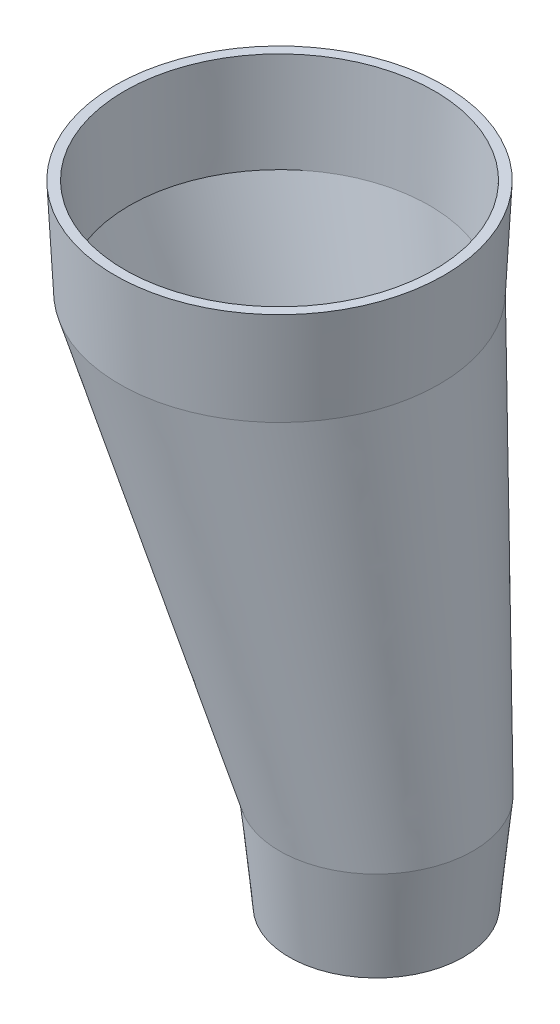
ISO-10303-21;
HEADER;
FILE_DESCRIPTION(('STEP AP214'),'2;1');
FILE_NAME('part.step','',(''),(''),'','','');
FILE_SCHEMA(('AUTOMOTIVE_DESIGN { 1 0 10303 214 1 1 1 1 }'));
ENDSEC;
DATA;
#1=APPLICATION_CONTEXT('core data for automotive mechanical design processes');
#2=APPLICATION_PROTOCOL_DEFINITION('international standard','automotive_design',2000,#1);
#3=PRODUCT_CONTEXT('',#1,'mechanical');
#4=PRODUCT('Part','Part','',(#3));
#5=PRODUCT_RELATED_PRODUCT_CATEGORY('part','',(#4));
#6=PRODUCT_DEFINITION_FORMATION('','',#4);
#7=PRODUCT_DEFINITION_CONTEXT('part definition',#1,'design');
#8=PRODUCT_DEFINITION('design','',#6,#7);
#9=PRODUCT_DEFINITION_SHAPE('','',#8);
#10=(LENGTH_UNIT() NAMED_UNIT(*) SI_UNIT(.MILLI.,.METRE.));
#11=(NAMED_UNIT(*) PLANE_ANGLE_UNIT() SI_UNIT($,.RADIAN.));
#12=(NAMED_UNIT(*) SI_UNIT($,.STERADIAN.) SOLID_ANGLE_UNIT());
#13=UNCERTAINTY_MEASURE_WITH_UNIT(LENGTH_MEASURE(1.E-05),#10,'distance_accuracy_value','');
#14=(GEOMETRIC_REPRESENTATION_CONTEXT(3) GLOBAL_UNCERTAINTY_ASSIGNED_CONTEXT((#13)) GLOBAL_UNIT_ASSIGNED_CONTEXT((#10,
#11,#12)) REPRESENTATION_CONTEXT('',''));
#15=CARTESIAN_POINT('',(0.,0.,0.));
#16=DIRECTION('',(0.,0.,1.));
#17=DIRECTION('',(1.,0.,0.));
#18=AXIS2_PLACEMENT_3D('',#15,#16,#17);
#19=CARTESIAN_POINT('',(-10.3448128465854,73.9407182466915,-17.1284004389751));
#20=CARTESIAN_POINT('',(5.81037430682914,77.8814364933829,-17.128400438975));
#21=CARTESIAN_POINT('',(5.810374306829,77.8814364933828,1.48581032204373E-13));
#22=CARTESIAN_POINT('',(5.81037430682885,77.8814364933829,17.1284004389753));
#23=CARTESIAN_POINT('',(-10.3448128465856,73.9407182466914,17.1284004389751));
#24=CARTESIAN_POINT('',(-26.5000000000001,70.0000000000001,17.128400438975));
#25=CARTESIAN_POINT('',(-26.5,70.,-1.44140140105872E-13));
#26=CARTESIAN_POINT('',(-26.4999999999999,70.0000000000001,-17.1284004389753));
#27=CARTESIAN_POINT('',(-10.3448128465854,73.9407182466915,-17.1284004389751));
#28=CARTESIAN_POINT('',(0.941466344145809,27.6720075249761,-9.61498398417449));
#29=CARTESIAN_POINT('',(10.0101395278933,29.8841196812207,-9.6149839841744));
#30=CARTESIAN_POINT('',(10.0101395278932,29.8841196812207,0.));
#31=CARTESIAN_POINT('',(10.0101395278931,29.8841196812207,9.61498398417458));
#32=CARTESIAN_POINT('',(0.941466344145641,27.6720075249761,9.6149839841745));
#33=CARTESIAN_POINT('',(-8.12720683960182,25.4598953687315,9.61498398417441));
#34=CARTESIAN_POINT('',(-8.12720683960174,25.4598953687315,0.));
#35=CARTESIAN_POINT('',(-8.12720683960166,25.4598953687315,-9.61498398417458));
#36=CARTESIAN_POINT('',(0.941466344145809,27.6720075249761,-9.61498398417449));
#37=(BOUNDED_SURFACE() B_SPLINE_SURFACE(1,2,((#19,#20,#21,#22,#23,#24,#25,#26,#27),(#28,#29,#30,
#31,#32,#33,#34,#35,#36)),.UNSPECIFIED.,.F.,.T.,.F.) B_SPLINE_SURFACE_WITH_KNOTS((2,2),(3,2,2,2,
3),(-0.239743942062474,2.68029885740192),(-3.14159265358979,-1.5707963267949,0.,1.5707963267949,
3.14159265358979),.UNSPECIFIED.) GEOMETRIC_REPRESENTATION_ITEM() RATIONAL_B_SPLINE_SURFACE(((1.,
0.707106781186548,1.,0.707106781186548,1.,0.707106781186548,1.,0.707106781186548,1.),(1.,
0.707106781186548,1.,0.707106781186548,1.,0.707106781186548,1.,0.707106781186548,1.))) REPRESENTATION_ITEM('') SURFACE());
#38=CARTESIAN_POINT('',(0.,30.,0.));
#39=DIRECTION('',(0.,1.,0.));
#40=DIRECTION('',(1.,0.,0.));
#41=AXIS2_PLACEMENT_3D('',#38,#39,#40);
#42=CIRCLE('',#41,10.);
#43=CARTESIAN_POINT('',(2.5,30.,9.68245836551854));
#44=VERTEX_POINT('',#43);
#45=CARTESIAN_POINT('',(2.5,30.,-9.68245836551854));
#46=VERTEX_POINT('',#45);
#47=EDGE_CURVE('E110',#44,#46,#42,.T.);
#48=CARTESIAN_POINT('',(0.,30.,0.));
#49=DIRECTION('',(0.,1.,0.));
#50=DIRECTION('',(1.,0.,0.));
#51=AXIS2_PLACEMENT_3D('',#48,#49,#50);
#52=CIRCLE('',#51,10.);
#53=CARTESIAN_POINT('',(0.373601525411852,30.,-9.99301865805373));
#54=VERTEX_POINT('',#53);
#55=EDGE_CURVE('E172',#46,#54,#52,.T.);
#56=CARTESIAN_POINT('',(0.37360152541185,30.,-9.99301865805373));
#57=CARTESIAN_POINT('',(-9.38355748307045,70.,-16.4884807857887));
#58=(BOUNDED_CURVE() B_SPLINE_CURVE(1,(#56,#57),.UNSPECIFIED.,.F.,
.F.) B_SPLINE_CURVE_WITH_KNOTS((2,2),(-2.53337802131494,-0.00895687024627903),
.UNSPECIFIED.) CURVE() GEOMETRIC_REPRESENTATION_ITEM() RATIONAL_B_SPLINE_CURVE((1.,1.)) REPRESENTATION_ITEM(''));
#59=CARTESIAN_POINT('',(-9.38355748307045,70.,-16.4884807857887));
#60=VERTEX_POINT('',#59);
#61=EDGE_CURVE('E11',#54,#60,#58,.T.);
#62=CARTESIAN_POINT('',(-10.,70.,0.));
#63=DIRECTION('',(0.,-1.,0.));
#64=DIRECTION('',(1.,0.,0.));
#65=AXIS2_PLACEMENT_3D('',#62,#63,#64);
#66=CIRCLE('',#65,16.5);
#67=CARTESIAN_POINT('',(-2.575,70.,-14.7349711570807));
#68=VERTEX_POINT('',#67);
#69=EDGE_CURVE('E209',#60,#68,#66,.T.);
#70=CARTESIAN_POINT('',(-10.,70.,0.));
#71=DIRECTION('',(0.,-1.,0.));
#72=DIRECTION('',(1.,0.,0.));
#73=AXIS2_PLACEMENT_3D('',#70,#71,#72);
#74=CIRCLE('',#73,16.5);
#75=CARTESIAN_POINT('',(-2.575,70.,14.7349711570807));
#76=VERTEX_POINT('',#75);
#77=EDGE_CURVE('E169',#68,#76,#74,.T.);
#78=CARTESIAN_POINT('',(-10.,70.,0.));
#79=DIRECTION('',(0.,-1.,0.));
#80=DIRECTION('',(1.,0.,0.));
#81=AXIS2_PLACEMENT_3D('',#78,#79,#80);
#82=CIRCLE('',#81,16.5);
#83=CARTESIAN_POINT('',(-26.5,70.,0.));
#84=VERTEX_POINT('',#83);
#85=EDGE_CURVE('E26',#76,#84,#82,.T.);
#86=CARTESIAN_POINT('',(-10.,70.,0.));
#87=DIRECTION('',(0.,-1.,0.));
#88=DIRECTION('',(1.,0.,0.));
#89=AXIS2_PLACEMENT_3D('',#86,#87,#88);
#90=CIRCLE('',#89,16.5);
#91=EDGE_CURVE('E206',#84,#60,#90,.T.);
#92=CARTESIAN_POINT('',(0.,30.,0.));
#93=DIRECTION('',(0.,1.,0.));
#94=DIRECTION('',(1.,0.,0.));
#95=AXIS2_PLACEMENT_3D('',#92,#93,#94);
#96=CIRCLE('',#95,10.);
#97=CARTESIAN_POINT('',(-10.,30.,0.));
#98=VERTEX_POINT('',#97);
#99=EDGE_CURVE('E164',#54,#98,#96,.T.);
#100=CARTESIAN_POINT('',(0.,30.,0.));
#101=DIRECTION('',(0.,1.,0.));
#102=DIRECTION('',(1.,0.,0.));
#103=AXIS2_PLACEMENT_3D('',#100,#101,#102);
#104=CIRCLE('',#103,10.);
#105=EDGE_CURVE('E121',#98,#44,#104,.T.);
#106=ORIENTED_EDGE('',*,*,#47,.T.);
#107=ORIENTED_EDGE('',*,*,#55,.T.);
#108=ORIENTED_EDGE('',*,*,#61,.T.);
#109=ORIENTED_EDGE('',*,*,#69,.T.);
#110=ORIENTED_EDGE('',*,*,#77,.T.);
#111=ORIENTED_EDGE('',*,*,#85,.T.);
#112=ORIENTED_EDGE('',*,*,#91,.T.);
#113=ORIENTED_EDGE('',*,*,#61,.F.);
#114=ORIENTED_EDGE('',*,*,#99,.T.);
#115=ORIENTED_EDGE('',*,*,#105,.T.);
#116=EDGE_LOOP('',(#106,#107,#108,#109,#110,#111,#112,#113,#114,#115));
#117=FACE_BOUND('',#116,.T.);
#118=ADVANCED_FACE('F16',(#117),#37,.F.);
#119=CARTESIAN_POINT('',(-10.,80.,0.));
#120=DIRECTION('',(0.,1.,0.));
#121=DIRECTION('',(1.,0.,0.));
#122=AXIS2_PLACEMENT_3D('',#119,#120,#121);
#123=CONICAL_SURFACE('',#122,17.,0.0499583957219433);
#124=ORIENTED_EDGE('',*,*,#77,.F.);
#125=ORIENTED_EDGE('',*,*,#69,.F.);
#126=ORIENTED_EDGE('',*,*,#91,.F.);
#127=DIRECTION('',(-0.0499376169438923,0.998752338877845,0.));
#128=VECTOR('',#127,1.);
#129=CARTESIAN_POINT('',(-27.,80.,0.));
#130=LINE('',#129,#128);
#131=CARTESIAN_POINT('',(-27.,80.,0.));
#132=VERTEX_POINT('',#131);
#133=EDGE_CURVE('E158',#84,#132,#130,.T.);
#134=ORIENTED_EDGE('',*,*,#133,.T.);
#135=CARTESIAN_POINT('',(-10.,80.,0.));
#136=DIRECTION('',(0.,-1.,0.));
#137=DIRECTION('',(1.,0.,0.));
#138=AXIS2_PLACEMENT_3D('',#135,#136,#137);
#139=CIRCLE('',#138,17.);
#140=EDGE_CURVE('E137',#132,#132,#139,.T.);
#141=ORIENTED_EDGE('',*,*,#140,.T.);
#142=ORIENTED_EDGE('',*,*,#133,.F.);
#143=ORIENTED_EDGE('',*,*,#85,.F.);
#144=EDGE_LOOP('',(#124,#125,#126,#134,#141,#142,#143));
#145=FACE_BOUND('',#144,.T.);
#146=ADVANCED_FACE('F241',(#145),#123,.T.);
#147=CARTESIAN_POINT('',(-10.,80.,0.));
#148=DIRECTION('',(0.,-1.,0.));
#149=DIRECTION('',(0.,0.,-1.));
#150=AXIS2_PLACEMENT_3D('',#147,#148,#149);
#151=PLANE('',#150);
#152=CARTESIAN_POINT('',(-10.,80.,0.));
#153=DIRECTION('',(0.,-1.,0.));
#154=DIRECTION('',(1.,0.,0.));
#155=AXIS2_PLACEMENT_3D('',#152,#153,#154);
#156=CIRCLE('',#155,16.);
#157=CARTESIAN_POINT('',(-26.,80.,0.));
#158=VERTEX_POINT('',#157);
#159=EDGE_CURVE('E154',#158,#158,#156,.T.);
#160=ORIENTED_EDGE('',*,*,#159,.T.);
#161=EDGE_LOOP('',(#160));
#162=FACE_BOUND('',#161,.T.);
#163=ORIENTED_EDGE('',*,*,#140,.F.);
#164=EDGE_LOOP('',(#163));
#165=FACE_BOUND('',#164,.T.);
#166=ADVANCED_FACE('F246',(#162,#165),#151,.F.);
#167=CARTESIAN_POINT('',(-10.3239150983073,73.7018868378011,-16.0903155638857));
#168=CARTESIAN_POINT('',(4.85216980338507,77.4037736756022,-16.0903155638855));
#169=CARTESIAN_POINT('',(4.85216980338482,77.4037736756021,2.51144113933323E-13));
#170=CARTESIAN_POINT('',(4.85216980338457,77.403773675602,16.090315563886));
#171=CARTESIAN_POINT('',(-10.3239150983078,73.701886837801,16.0903155638857));
#172=CARTESIAN_POINT('',(-25.5000000000003,69.9999999999999,16.0903155638855));
#173=CARTESIAN_POINT('',(-25.5,70.,-2.46703221834823E-13));
#174=CARTESIAN_POINT('',(-25.4999999999998,70.0000000000001,-16.090315563886));
#175=CARTESIAN_POINT('',(-10.3239150983073,73.7018868378011,-16.0903155638857));
#176=CARTESIAN_POINT('',(0.845653295200106,27.9116383287942,-8.65459493864009));
#177=CARTESIAN_POINT('',(9.00850548147761,29.9027944974003,-8.65459493863996));
#178=CARTESIAN_POINT('',(9.00850548147748,29.9027944974003,1.3397777248267E-13));
#179=CARTESIAN_POINT('',(9.00850548147735,29.9027944974003,8.65459493864022));
#180=CARTESIAN_POINT('',(0.84565329519984,27.9116383287941,8.65459493864009));
#181=CARTESIAN_POINT('',(-7.31719889107766,25.9204821601879,8.65459493863996));
#182=CARTESIAN_POINT('',(-7.31719889107753,25.9204821601879,-1.2953688038417E-13));
#183=CARTESIAN_POINT('',(-7.3171988910774,25.920482160188,-8.65459493864022));
#184=CARTESIAN_POINT('',(0.845653295200106,27.9116383287942,-8.65459493864009));
#185=(BOUNDED_SURFACE() B_SPLINE_SURFACE(1,2,((#167,#168,#169,#170,#171,#172,#173,#174,#175),
(#176,#177,#178,#179,#180,#181,#182,#183,#184)),.UNSPECIFIED.,.F.,.T.,
.F.) B_SPLINE_SURFACE_WITH_KNOTS((2,2),(3,2,2,2,3),(-0.239743942062475,2.83654458294664),
(-3.14159265358979,-1.5707963267949,0.,1.5707963267949,3.14159265358979),
.UNSPECIFIED.) GEOMETRIC_REPRESENTATION_ITEM() RATIONAL_B_SPLINE_SURFACE(((1.,0.707106781186548,
1.,0.707106781186548,1.,0.707106781186548,1.,0.707106781186548,1.),(1.,0.707106781186548,1.,
0.707106781186548,1.,0.707106781186548,1.,0.707106781186548,1.))) REPRESENTATION_ITEM('') SURFACE());
#186=CARTESIAN_POINT('',(-10.,70.,0.));
#187=DIRECTION('',(0.,-1.,0.));
#188=DIRECTION('',(1.,0.,0.));
#189=AXIS2_PLACEMENT_3D('',#186,#187,#188);
#190=CIRCLE('',#189,15.5);
#191=CARTESIAN_POINT('',(-3.025,70.,-13.8419426021061));
#192=VERTEX_POINT('',#191);
#193=CARTESIAN_POINT('',(-3.025,70.,13.8419426021061));
#194=VERTEX_POINT('',#193);
#195=EDGE_CURVE('E142',#192,#194,#190,.T.);
#196=CARTESIAN_POINT('',(-10.,70.,0.));
#197=DIRECTION('',(0.,-1.,0.));
#198=DIRECTION('',(1.,0.,0.));
#199=AXIS2_PLACEMENT_3D('',#196,#197,#198);
#200=CIRCLE('',#199,15.5);
#201=CARTESIAN_POINT('',(-9.42091763561152,70.,-15.4891789199833));
#202=VERTEX_POINT('',#201);
#203=EDGE_CURVE('E20',#202,#192,#200,.T.);
#204=CARTESIAN_POINT('',(-9.42091763561152,70.,-15.4891789199833));
#205=CARTESIAN_POINT('',(0.336241372870726,30.,-8.99371679224836));
#206=(BOUNDED_CURVE() B_SPLINE_CURVE(1,(#204,#205),.UNSPECIFIED.,.F.,
.F.) B_SPLINE_CURVE_WITH_KNOTS((2,2),(0.0089568702462805,2.69624390202905),
.UNSPECIFIED.) CURVE() GEOMETRIC_REPRESENTATION_ITEM() RATIONAL_B_SPLINE_CURVE((1.,1.)) REPRESENTATION_ITEM(''));
#207=CARTESIAN_POINT('',(0.33624137287073,30.,-8.99371679224836));
#208=VERTEX_POINT('',#207);
#209=EDGE_CURVE('E127',#202,#208,#206,.T.);
#210=CARTESIAN_POINT('',(0.,30.,0.));
#211=DIRECTION('',(0.,1.,0.));
#212=DIRECTION('',(0.037360152541159,0.,0.999301865805374));
#213=AXIS2_PLACEMENT_3D('',#210,#211,#212);
#214=CIRCLE('',#213,9.);
#215=CARTESIAN_POINT('',(2.25,30.,-8.7142125289667));
#216=VERTEX_POINT('',#215);
#217=EDGE_CURVE('E186',#216,#208,#214,.T.);
#218=CARTESIAN_POINT('',(0.,30.,0.));
#219=DIRECTION('',(0.,1.,0.));
#220=DIRECTION('',(0.037360152541159,0.,0.999301865805374));
#221=AXIS2_PLACEMENT_3D('',#218,#219,#220);
#222=CIRCLE('',#221,9.);
#223=CARTESIAN_POINT('',(2.25,30.,8.7142125289667));
#224=VERTEX_POINT('',#223);
#225=EDGE_CURVE('E188',#224,#216,#222,.T.);
#226=CARTESIAN_POINT('',(0.,30.,0.));
#227=DIRECTION('',(0.,1.,0.));
#228=DIRECTION('',(0.037360152541159,0.,0.999301865805374));
#229=AXIS2_PLACEMENT_3D('',#226,#227,#228);
#230=CIRCLE('',#229,9.);
#231=CARTESIAN_POINT('',(-9.,30.,0.));
#232=VERTEX_POINT('',#231);
#233=EDGE_CURVE('E184',#232,#224,#230,.T.);
#234=CARTESIAN_POINT('',(0.,30.,0.));
#235=DIRECTION('',(0.,1.,0.));
#236=DIRECTION('',(0.037360152541159,0.,0.999301865805374));
#237=AXIS2_PLACEMENT_3D('',#234,#235,#236);
#238=CIRCLE('',#237,9.);
#239=EDGE_CURVE('E134',#208,#232,#238,.T.);
#240=CARTESIAN_POINT('',(-10.,70.,0.));
#241=DIRECTION('',(0.,-1.,0.));
#242=DIRECTION('',(1.,0.,0.));
#243=AXIS2_PLACEMENT_3D('',#240,#241,#242);
#244=CIRCLE('',#243,15.5);
#245=CARTESIAN_POINT('',(-25.5,70.,0.));
#246=VERTEX_POINT('',#245);
#247=EDGE_CURVE('E131',#246,#202,#244,.T.);
#248=CARTESIAN_POINT('',(-10.,70.,0.));
#249=DIRECTION('',(0.,-1.,0.));
#250=DIRECTION('',(1.,0.,0.));
#251=AXIS2_PLACEMENT_3D('',#248,#249,#250);
#252=CIRCLE('',#251,15.5);
#253=EDGE_CURVE('E138',#194,#246,#252,.T.);
#254=ORIENTED_EDGE('',*,*,#195,.F.);
#255=ORIENTED_EDGE('',*,*,#203,.F.);
#256=ORIENTED_EDGE('',*,*,#209,.T.);
#257=ORIENTED_EDGE('',*,*,#217,.F.);
#258=ORIENTED_EDGE('',*,*,#225,.F.);
#259=ORIENTED_EDGE('',*,*,#233,.F.);
#260=ORIENTED_EDGE('',*,*,#239,.F.);
#261=ORIENTED_EDGE('',*,*,#209,.F.);
#262=ORIENTED_EDGE('',*,*,#247,.F.);
#263=ORIENTED_EDGE('',*,*,#253,.F.);
#264=EDGE_LOOP('',(#254,#255,#256,#257,#258,#259,#260,#261,#262,#263));
#265=FACE_BOUND('',#264,.T.);
#266=ADVANCED_FACE('F129',(#265),#185,.T.);
#267=CARTESIAN_POINT('',(-10.,80.,0.));
#268=DIRECTION('',(0.,1.,0.));
#269=DIRECTION('',(1.,0.,0.));
#270=AXIS2_PLACEMENT_3D('',#267,#268,#269);
#271=CONICAL_SURFACE('',#270,16.,0.0499583957219433);
#272=ORIENTED_EDGE('',*,*,#159,.F.);
#273=DIRECTION('',(0.0499376169438923,-0.998752338877845,0.));
#274=VECTOR('',#273,1.);
#275=CARTESIAN_POINT('',(-26.,80.,0.));
#276=LINE('',#275,#274);
#277=EDGE_CURVE('E147',#158,#246,#276,.T.);
#278=ORIENTED_EDGE('',*,*,#277,.T.);
#279=ORIENTED_EDGE('',*,*,#247,.T.);
#280=ORIENTED_EDGE('',*,*,#203,.T.);
#281=ORIENTED_EDGE('',*,*,#195,.T.);
#282=ORIENTED_EDGE('',*,*,#253,.T.);
#283=ORIENTED_EDGE('',*,*,#277,.F.);
#284=EDGE_LOOP('',(#272,#278,#279,#280,#281,#282,#283));
#285=FACE_BOUND('',#284,.T.);
#286=ADVANCED_FACE('F146',(#285),#271,.F.);
#287=CARTESIAN_POINT('',(0.,30.,0.));
#288=DIRECTION('',(0.,1.,0.));
#289=DIRECTION('',(1.,0.,0.));
#290=AXIS2_PLACEMENT_3D('',#287,#288,#289);
#291=CONICAL_SURFACE('',#290,10.,0.0996686524911618);
#292=CARTESIAN_POINT('',(0.,20.,0.));
#293=DIRECTION('',(0.,1.,0.));
#294=DIRECTION('',(1.,0.,0.));
#295=AXIS2_PLACEMENT_3D('',#292,#293,#294);
#296=CIRCLE('',#295,9.);
#297=CARTESIAN_POINT('',(-9.,20.,0.));
#298=VERTEX_POINT('',#297);
#299=EDGE_CURVE('E165',#298,#298,#296,.T.);
#300=ORIENTED_EDGE('',*,*,#299,.T.);
#301=DIRECTION('',(-0.0995037190209988,0.995037190209989,0.));
#302=VECTOR('',#301,1.);
#303=CARTESIAN_POINT('',(-10.,30.,0.));
#304=LINE('',#303,#302);
#305=EDGE_CURVE('E160',#298,#98,#304,.T.);
#306=ORIENTED_EDGE('',*,*,#305,.T.);
#307=ORIENTED_EDGE('',*,*,#99,.F.);
#308=ORIENTED_EDGE('',*,*,#55,.F.);
#309=ORIENTED_EDGE('',*,*,#47,.F.);
#310=ORIENTED_EDGE('',*,*,#105,.F.);
#311=ORIENTED_EDGE('',*,*,#305,.F.);
#312=EDGE_LOOP('',(#300,#306,#307,#308,#309,#310,#311));
#313=FACE_BOUND('',#312,.T.);
#314=ADVANCED_FACE('F238',(#313),#291,.T.);
#315=CARTESIAN_POINT('',(0.,20.,0.));
#316=DIRECTION('',(0.,1.,0.));
#317=DIRECTION('',(1.,0.,0.));
#318=AXIS2_PLACEMENT_3D('',#315,#316,#317);
#319=PLANE('',#318);
#320=CARTESIAN_POINT('',(0.,20.,0.));
#321=DIRECTION('',(0.,1.,0.));
#322=DIRECTION('',(1.,0.,0.));
#323=AXIS2_PLACEMENT_3D('',#320,#321,#322);
#324=CIRCLE('',#323,8.);
#325=CARTESIAN_POINT('',(-8.,20.,0.));
#326=VERTEX_POINT('',#325);
#327=EDGE_CURVE('E204',#326,#326,#324,.T.);
#328=ORIENTED_EDGE('',*,*,#327,.T.);
#329=EDGE_LOOP('',(#328));
#330=FACE_BOUND('',#329,.T.);
#331=ORIENTED_EDGE('',*,*,#299,.F.);
#332=EDGE_LOOP('',(#331));
#333=FACE_BOUND('',#332,.T.);
#334=ADVANCED_FACE('F18',(#330,#333),#319,.F.);
#335=CARTESIAN_POINT('',(0.,30.,0.));
#336=DIRECTION('',(0.,1.,0.));
#337=DIRECTION('',(1.,0.,0.));
#338=AXIS2_PLACEMENT_3D('',#335,#336,#337);
#339=CONICAL_SURFACE('',#338,9.,0.0996686524911618);
#340=ORIENTED_EDGE('',*,*,#225,.T.);
#341=ORIENTED_EDGE('',*,*,#217,.T.);
#342=ORIENTED_EDGE('',*,*,#239,.T.);
#343=DIRECTION('',(0.0995037190209989,-0.995037190209989,0.));
#344=VECTOR('',#343,1.);
#345=CARTESIAN_POINT('',(-9.,30.,0.));
#346=LINE('',#345,#344);
#347=EDGE_CURVE('E195',#232,#326,#346,.T.);
#348=ORIENTED_EDGE('',*,*,#347,.T.);
#349=ORIENTED_EDGE('',*,*,#327,.F.);
#350=ORIENTED_EDGE('',*,*,#347,.F.);
#351=ORIENTED_EDGE('',*,*,#233,.T.);
#352=EDGE_LOOP('',(#340,#341,#342,#348,#349,#350,#351));
#353=FACE_BOUND('',#352,.T.);
#354=ADVANCED_FACE('F232',(#353),#339,.F.);
#355=CLOSED_SHELL('',(#118,#146,#166,#266,#286,#314,#334,#354));
#356=MANIFOLD_SOLID_BREP('B1',#355);
#357=ADVANCED_BREP_SHAPE_REPRESENTATION('',(#18,#356),#14);
#358=SHAPE_DEFINITION_REPRESENTATION(#9,#357);
ENDSEC;
END-ISO-10303-21;
